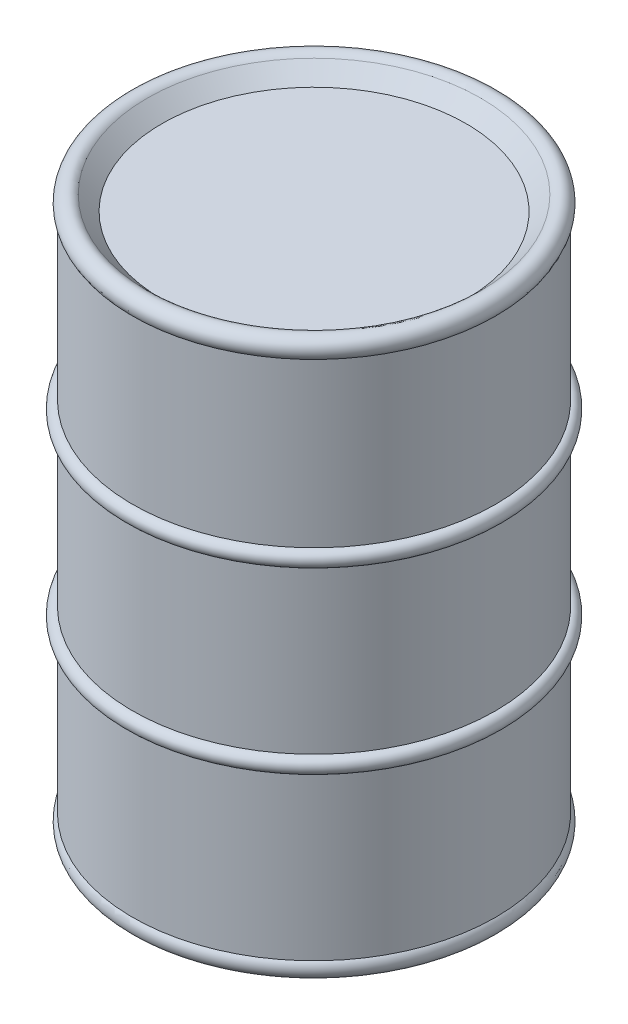
ISO-10303-21;
HEADER;
FILE_DESCRIPTION(('STEP AP214'),'2;1');
FILE_NAME('part.step','',(''),(''),'','','');
FILE_SCHEMA(('AUTOMOTIVE_DESIGN { 1 0 10303 214 1 1 1 1 }'));
ENDSEC;
DATA;
#1=APPLICATION_CONTEXT('core data for automotive mechanical design processes');
#2=APPLICATION_PROTOCOL_DEFINITION('international standard','automotive_design',2000,#1);
#3=PRODUCT_CONTEXT('',#1,'mechanical');
#4=PRODUCT('Part','Part','',(#3));
#5=PRODUCT_RELATED_PRODUCT_CATEGORY('part','',(#4));
#6=PRODUCT_DEFINITION_FORMATION('','',#4);
#7=PRODUCT_DEFINITION_CONTEXT('part definition',#1,'design');
#8=PRODUCT_DEFINITION('design','',#6,#7);
#9=PRODUCT_DEFINITION_SHAPE('','',#8);
#10=(LENGTH_UNIT() NAMED_UNIT(*) SI_UNIT(.MILLI.,.METRE.));
#11=(NAMED_UNIT(*) PLANE_ANGLE_UNIT() SI_UNIT($,.RADIAN.));
#12=(NAMED_UNIT(*) SI_UNIT($,.STERADIAN.) SOLID_ANGLE_UNIT());
#13=UNCERTAINTY_MEASURE_WITH_UNIT(LENGTH_MEASURE(1.E-05),#10,'distance_accuracy_value','');
#14=(GEOMETRIC_REPRESENTATION_CONTEXT(3) GLOBAL_UNCERTAINTY_ASSIGNED_CONTEXT((#13)) GLOBAL_UNIT_ASSIGNED_CONTEXT((#10,
#11,#12)) REPRESENTATION_CONTEXT('',''));
#15=CARTESIAN_POINT('',(0.,0.,0.));
#16=DIRECTION('',(0.,0.,1.));
#17=DIRECTION('',(1.,0.,0.));
#18=AXIS2_PLACEMENT_3D('',#15,#16,#17);
#19=CARTESIAN_POINT('',(244.755389820755,0.,0.));
#20=DIRECTION('',(0.,-1.,0.));
#21=DIRECTION('',(1.,0.,0.));
#22=AXIS2_PLACEMENT_3D('',#19,#20,#21);
#23=PLANE('',#22);
#24=CARTESIAN_POINT('',(0.,0.,0.));
#25=DIRECTION('',(0.,-1.,0.));
#26=DIRECTION('',(1.,0.,0.));
#27=AXIS2_PLACEMENT_3D('',#24,#25,#26);
#28=CIRCLE('',#27,244.755389820755);
#29=CARTESIAN_POINT('',(244.755389820755,0.,0.));
#30=VERTEX_POINT('',#29);
#31=EDGE_CURVE('E10',#30,#30,#28,.T.);
#32=ORIENTED_EDGE('',*,*,#31,.T.);
#33=EDGE_LOOP('',(#32));
#34=FACE_BOUND('',#33,.T.);
#35=ADVANCED_FACE('F33',(#34),#23,.T.);
#36=CARTESIAN_POINT('',(0.,0.,0.));
#37=DIRECTION('',(0.,-1.,0.));
#38=DIRECTION('',(1.,0.,0.));
#39=AXIS2_PLACEMENT_3D('',#36,#37,#38);
#40=CONICAL_SURFACE('',#39,244.755389820755,0.785398163397449);
#41=CARTESIAN_POINT('',(0.,-23.6723050896224,0.));
#42=DIRECTION('',(0.,-1.,0.));
#43=DIRECTION('',(1.,0.,0.));
#44=AXIS2_PLACEMENT_3D('',#41,#42,#43);
#45=CIRCLE('',#44,268.427694910378);
#46=CARTESIAN_POINT('',(268.427694910378,-23.6723050896224,0.));
#47=VERTEX_POINT('',#46);
#48=EDGE_CURVE('E40',#47,#47,#45,.T.);
#49=ORIENTED_EDGE('',*,*,#48,.T.);
#50=EDGE_LOOP('',(#49));
#51=FACE_BOUND('',#50,.T.);
#52=ORIENTED_EDGE('',*,*,#31,.F.);
#53=EDGE_LOOP('',(#52));
#54=FACE_BOUND('',#53,.T.);
#55=ADVANCED_FACE('F130',(#51,#54),#40,.F.);
#56=CARTESIAN_POINT('',(0.,-11.8361525448112,0.));
#57=DIRECTION('',(0.,-1.,0.));
#58=DIRECTION('',(1.,0.,0.));
#59=AXIS2_PLACEMENT_3D('',#56,#57,#58);
#60=TOROIDAL_SURFACE('',#59,280.263847455189,16.7388474551888);
#61=CARTESIAN_POINT('',(0.,0.,0.));
#62=DIRECTION('',(0.,-1.,0.));
#63=DIRECTION('',(1.,0.,0.));
#64=AXIS2_PLACEMENT_3D('',#61,#62,#63);
#65=CIRCLE('',#64,292.1);
#66=CARTESIAN_POINT('',(292.1,0.,0.));
#67=VERTEX_POINT('',#66);
#68=EDGE_CURVE('E44',#67,#67,#65,.T.);
#69=ORIENTED_EDGE('',*,*,#68,.T.);
#70=EDGE_LOOP('',(#69));
#71=FACE_BOUND('',#70,.T.);
#72=ORIENTED_EDGE('',*,*,#48,.F.);
#73=EDGE_LOOP('',(#72));
#74=FACE_BOUND('',#73,.T.);
#75=ADVANCED_FACE('F127',(#71,#74),#60,.T.);
#76=CARTESIAN_POINT('',(0.,0.911859999999965,0.));
#77=DIRECTION('',(0.,-1.,0.));
#78=DIRECTION('',(1.,0.,0.));
#79=AXIS2_PLACEMENT_3D('',#76,#77,#78);
#80=CYLINDRICAL_SURFACE('',#79,292.1);
#81=CARTESIAN_POINT('',(0.,262.466666666667,0.));
#82=DIRECTION('',(0.,-1.,0.));
#83=DIRECTION('',(1.,0.,0.));
#84=AXIS2_PLACEMENT_3D('',#81,#82,#83);
#85=CIRCLE('',#84,292.1);
#86=CARTESIAN_POINT('',(292.1,262.466666666667,0.));
#87=VERTEX_POINT('',#86);
#88=EDGE_CURVE('E48',#87,#87,#85,.T.);
#89=ORIENTED_EDGE('',*,*,#88,.T.);
#90=EDGE_LOOP('',(#89));
#91=FACE_BOUND('',#90,.T.);
#92=ORIENTED_EDGE('',*,*,#68,.F.);
#93=EDGE_LOOP('',(#92));
#94=FACE_BOUND('',#93,.T.);
#95=ADVANCED_FACE('F123',(#91,#94),#80,.T.);
#96=CARTESIAN_POINT('',(0.,275.166666666667,0.));
#97=DIRECTION('',(0.,-1.,0.));
#98=DIRECTION('',(1.,0.,0.));
#99=AXIS2_PLACEMENT_3D('',#96,#97,#98);
#100=TOROIDAL_SURFACE('',#99,292.1,12.7);
#101=CARTESIAN_POINT('',(0.,287.866666666667,0.));
#102=DIRECTION('',(0.,-1.,0.));
#103=DIRECTION('',(1.,0.,0.));
#104=AXIS2_PLACEMENT_3D('',#101,#102,#103);
#105=CIRCLE('',#104,292.1);
#106=CARTESIAN_POINT('',(292.1,287.866666666667,0.));
#107=VERTEX_POINT('',#106);
#108=EDGE_CURVE('E53',#107,#107,#105,.T.);
#109=ORIENTED_EDGE('',*,*,#108,.T.);
#110=EDGE_LOOP('',(#109));
#111=FACE_BOUND('',#110,.T.);
#112=ORIENTED_EDGE('',*,*,#88,.F.);
#113=EDGE_LOOP('',(#112));
#114=FACE_BOUND('',#113,.T.);
#115=ADVANCED_FACE('F119',(#111,#114),#100,.T.);
#116=CARTESIAN_POINT('',(0.,0.911859999999965,0.));
#117=DIRECTION('',(0.,-1.,0.));
#118=DIRECTION('',(1.,0.,0.));
#119=AXIS2_PLACEMENT_3D('',#116,#117,#118);
#120=CYLINDRICAL_SURFACE('',#119,292.1);
#121=CARTESIAN_POINT('',(0.,550.333333333333,0.));
#122=DIRECTION('',(0.,-1.,0.));
#123=DIRECTION('',(1.,0.,0.));
#124=AXIS2_PLACEMENT_3D('',#121,#122,#123);
#125=CIRCLE('',#124,292.1);
#126=CARTESIAN_POINT('',(292.1,550.333333333333,0.));
#127=VERTEX_POINT('',#126);
#128=EDGE_CURVE('E56',#127,#127,#125,.T.);
#129=ORIENTED_EDGE('',*,*,#128,.T.);
#130=EDGE_LOOP('',(#129));
#131=FACE_BOUND('',#130,.T.);
#132=ORIENTED_EDGE('',*,*,#108,.F.);
#133=EDGE_LOOP('',(#132));
#134=FACE_BOUND('',#133,.T.);
#135=ADVANCED_FACE('F115',(#131,#134),#120,.T.);
#136=CARTESIAN_POINT('',(0.,563.033333333333,0.));
#137=DIRECTION('',(0.,-1.,0.));
#138=DIRECTION('',(1.,0.,0.));
#139=AXIS2_PLACEMENT_3D('',#136,#137,#138);
#140=TOROIDAL_SURFACE('',#139,292.1,12.7);
#141=CARTESIAN_POINT('',(0.,575.733333333333,0.));
#142=DIRECTION('',(0.,-1.,0.));
#143=DIRECTION('',(1.,0.,0.));
#144=AXIS2_PLACEMENT_3D('',#141,#142,#143);
#145=CIRCLE('',#144,292.1);
#146=CARTESIAN_POINT('',(292.1,575.733333333333,0.));
#147=VERTEX_POINT('',#146);
#148=EDGE_CURVE('E59',#147,#147,#145,.T.);
#149=ORIENTED_EDGE('',*,*,#148,.T.);
#150=EDGE_LOOP('',(#149));
#151=FACE_BOUND('',#150,.T.);
#152=ORIENTED_EDGE('',*,*,#128,.F.);
#153=EDGE_LOOP('',(#152));
#154=FACE_BOUND('',#153,.T.);
#155=ADVANCED_FACE('F111',(#151,#154),#140,.T.);
#156=CARTESIAN_POINT('',(0.,0.911859999999965,0.));
#157=DIRECTION('',(0.,-1.,0.));
#158=DIRECTION('',(1.,0.,0.));
#159=AXIS2_PLACEMENT_3D('',#156,#157,#158);
#160=CYLINDRICAL_SURFACE('',#159,292.1);
#161=CARTESIAN_POINT('',(0.,838.2,0.));
#162=DIRECTION('',(0.,-1.,0.));
#163=DIRECTION('',(1.,0.,0.));
#164=AXIS2_PLACEMENT_3D('',#161,#162,#163);
#165=CIRCLE('',#164,292.1);
#166=CARTESIAN_POINT('',(292.1,838.2,0.));
#167=VERTEX_POINT('',#166);
#168=EDGE_CURVE('E62',#167,#167,#165,.T.);
#169=ORIENTED_EDGE('',*,*,#168,.T.);
#170=EDGE_LOOP('',(#169));
#171=FACE_BOUND('',#170,.T.);
#172=ORIENTED_EDGE('',*,*,#148,.F.);
#173=EDGE_LOOP('',(#172));
#174=FACE_BOUND('',#173,.T.);
#175=ADVANCED_FACE('F107',(#171,#174),#160,.T.);
#176=CARTESIAN_POINT('',(0.,850.036152544811,0.));
#177=DIRECTION('',(0.,-1.,0.));
#178=DIRECTION('',(1.,0.,0.));
#179=AXIS2_PLACEMENT_3D('',#176,#177,#178);
#180=TOROIDAL_SURFACE('',#179,280.263847455189,16.7388474551888);
#181=CARTESIAN_POINT('',(0.,861.872305089622,0.));
#182=DIRECTION('',(0.,-1.,0.));
#183=DIRECTION('',(1.,0.,0.));
#184=AXIS2_PLACEMENT_3D('',#181,#182,#183);
#185=CIRCLE('',#184,268.427694910378);
#186=CARTESIAN_POINT('',(268.427694910378,861.872305089622,0.));
#187=VERTEX_POINT('',#186);
#188=EDGE_CURVE('E65',#187,#187,#185,.T.);
#189=ORIENTED_EDGE('',*,*,#188,.T.);
#190=EDGE_LOOP('',(#189));
#191=FACE_BOUND('',#190,.T.);
#192=ORIENTED_EDGE('',*,*,#168,.F.);
#193=EDGE_LOOP('',(#192));
#194=FACE_BOUND('',#193,.T.);
#195=ADVANCED_FACE('F103',(#191,#194),#180,.T.);
#196=CARTESIAN_POINT('',(0.,861.872305089622,0.));
#197=DIRECTION('',(0.,1.,0.));
#198=DIRECTION('',(-1.,0.,0.));
#199=AXIS2_PLACEMENT_3D('',#196,#197,#198);
#200=CONICAL_SURFACE('',#199,268.427694910378,0.785398163397447);
#201=CARTESIAN_POINT('',(0.,838.2,0.));
#202=DIRECTION('',(0.,-1.,0.));
#203=DIRECTION('',(1.,0.,0.));
#204=AXIS2_PLACEMENT_3D('',#201,#202,#203);
#205=CIRCLE('',#204,244.755389820755);
#206=CARTESIAN_POINT('',(244.755389820755,838.2,0.));
#207=VERTEX_POINT('',#206);
#208=EDGE_CURVE('E68',#207,#207,#205,.T.);
#209=ORIENTED_EDGE('',*,*,#208,.T.);
#210=EDGE_LOOP('',(#209));
#211=FACE_BOUND('',#210,.T.);
#212=ORIENTED_EDGE('',*,*,#188,.F.);
#213=EDGE_LOOP('',(#212));
#214=FACE_BOUND('',#213,.T.);
#215=ADVANCED_FACE('F99',(#211,#214),#200,.F.);
#216=CARTESIAN_POINT('',(244.755389820755,838.2,0.));
#217=DIRECTION('',(0.,1.,0.));
#218=DIRECTION('',(-1.,0.,0.));
#219=AXIS2_PLACEMENT_3D('',#216,#217,#218);
#220=PLANE('',#219);
#221=ORIENTED_EDGE('',*,*,#208,.F.);
#222=EDGE_LOOP('',(#221));
#223=FACE_BOUND('',#222,.T.);
#224=ADVANCED_FACE('F97',(#223),#220,.T.);
#225=CLOSED_SHELL('',(#35,#55,#75,#95,#115,#135,#155,#175,#195,#215,#224));
#226=CARTESIAN_POINT('',(0.,837.28814,0.));
#227=DIRECTION('',(0.,-1.,0.));
#228=DIRECTION('',(1.,0.,0.));
#229=AXIS2_PLACEMENT_3D('',#226,#227,#228);
#230=PLANE('',#229);
#231=CARTESIAN_POINT('',(0.,837.28814,0.));
#232=DIRECTION('',(0.,-1.,0.));
#233=DIRECTION('',(1.,0.,0.));
#234=AXIS2_PLACEMENT_3D('',#231,#232,#233);
#235=CIRCLE('',#234,291.18814);
#236=CARTESIAN_POINT('',(291.18814,837.28814,0.));
#237=VERTEX_POINT('',#236);
#238=EDGE_CURVE('E71',#237,#237,#235,.T.);
#239=ORIENTED_EDGE('',*,*,#238,.T.);
#240=EDGE_LOOP('',(#239));
#241=FACE_BOUND('',#240,.T.);
#242=ADVANCED_FACE('F88',(#241),#230,.T.);
#243=CARTESIAN_POINT('',(0.,0.911859999999965,0.));
#244=DIRECTION('',(0.,-1.,0.));
#245=DIRECTION('',(1.,0.,0.));
#246=AXIS2_PLACEMENT_3D('',#243,#244,#245);
#247=CYLINDRICAL_SURFACE('',#246,291.18814);
#248=CARTESIAN_POINT('',(0.,0.911859999999988,0.));
#249=DIRECTION('',(0.,-1.,0.));
#250=DIRECTION('',(1.,0.,0.));
#251=AXIS2_PLACEMENT_3D('',#248,#249,#250);
#252=CIRCLE('',#251,291.18814);
#253=CARTESIAN_POINT('',(291.18814,0.91186,0.));
#254=VERTEX_POINT('',#253);
#255=EDGE_CURVE('E74',#254,#254,#252,.T.);
#256=ORIENTED_EDGE('',*,*,#255,.T.);
#257=EDGE_LOOP('',(#256));
#258=FACE_BOUND('',#257,.T.);
#259=ORIENTED_EDGE('',*,*,#238,.F.);
#260=EDGE_LOOP('',(#259));
#261=FACE_BOUND('',#260,.T.);
#262=ADVANCED_FACE('F78',(#258,#261),#247,.F.);
#263=CARTESIAN_POINT('',(291.18814,0.911859999999989,0.));
#264=DIRECTION('',(0.,1.,0.));
#265=DIRECTION('',(-1.,0.,0.));
#266=AXIS2_PLACEMENT_3D('',#263,#264,#265);
#267=PLANE('',#266);
#268=ORIENTED_EDGE('',*,*,#255,.F.);
#269=EDGE_LOOP('',(#268));
#270=FACE_BOUND('',#269,.T.);
#271=ADVANCED_FACE('F81',(#270),#267,.T.);
#272=CLOSED_SHELL('',(#242,#262,#271));
#273=ORIENTED_CLOSED_SHELL('',*,#272,.T.);
#274=BREP_WITH_VOIDS('B2',#225,(#273));
#275=ADVANCED_BREP_SHAPE_REPRESENTATION('',(#18,#274),#14);
#276=SHAPE_DEFINITION_REPRESENTATION(#9,#275);
ENDSEC;
END-ISO-10303-21;
